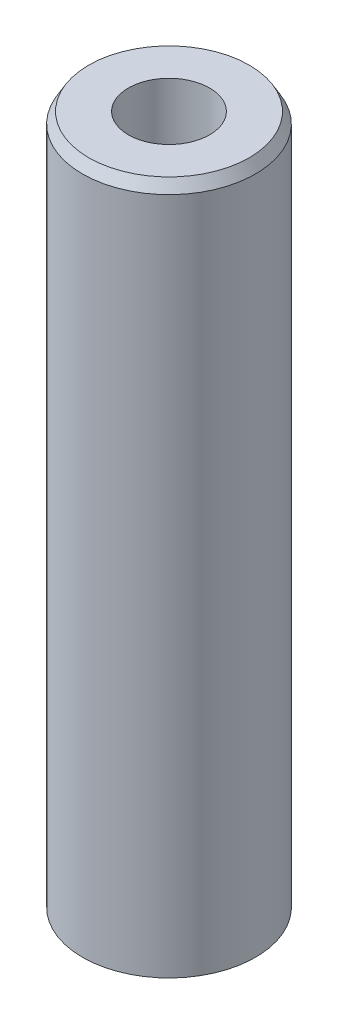
ISO-10303-21;
HEADER;
FILE_DESCRIPTION(('STEP AP214'),'2;1');
FILE_NAME('part.step','',(''),(''),'','','');
FILE_SCHEMA(('AUTOMOTIVE_DESIGN { 1 0 10303 214 1 1 1 1 }'));
ENDSEC;
DATA;
#1=APPLICATION_CONTEXT('core data for automotive mechanical design processes');
#2=APPLICATION_PROTOCOL_DEFINITION('international standard','automotive_design',2000,#1);
#3=PRODUCT_CONTEXT('',#1,'mechanical');
#4=PRODUCT('Part','Part','',(#3));
#5=PRODUCT_RELATED_PRODUCT_CATEGORY('part','',(#4));
#6=PRODUCT_DEFINITION_FORMATION('','',#4);
#7=PRODUCT_DEFINITION_CONTEXT('part definition',#1,'design');
#8=PRODUCT_DEFINITION('design','',#6,#7);
#9=PRODUCT_DEFINITION_SHAPE('','',#8);
#10=(LENGTH_UNIT() NAMED_UNIT(*) SI_UNIT(.MILLI.,.METRE.));
#11=(NAMED_UNIT(*) PLANE_ANGLE_UNIT() SI_UNIT($,.RADIAN.));
#12=(NAMED_UNIT(*) SI_UNIT($,.STERADIAN.) SOLID_ANGLE_UNIT());
#13=UNCERTAINTY_MEASURE_WITH_UNIT(LENGTH_MEASURE(1.E-05),#10,'distance_accuracy_value','');
#14=(GEOMETRIC_REPRESENTATION_CONTEXT(3) GLOBAL_UNCERTAINTY_ASSIGNED_CONTEXT((#13)) GLOBAL_UNIT_ASSIGNED_CONTEXT((#10,
#11,#12)) REPRESENTATION_CONTEXT('',''));
#15=CARTESIAN_POINT('',(0.,0.,0.));
#16=DIRECTION('',(0.,0.,1.));
#17=DIRECTION('',(1.,0.,0.));
#18=AXIS2_PLACEMENT_3D('',#15,#16,#17);
#19=CARTESIAN_POINT('',(0.,100.452609283221,0.));
#20=DIRECTION('',(0.,-1.,0.));
#21=DIRECTION('',(0.,0.,-1.));
#22=AXIS2_PLACEMENT_3D('',#19,#20,#21);
#23=CYLINDRICAL_SURFACE('',#22,12.5);
#24=CARTESIAN_POINT('',(0.,98.8770075101227,0.));
#25=DIRECTION('',(0.,1.,0.));
#26=DIRECTION('',(0.,0.,1.));
#27=AXIS2_PLACEMENT_3D('',#24,#25,#26);
#28=CIRCLE('',#27,12.5);
#29=CARTESIAN_POINT('',(0.,98.8770075101227,12.5));
#30=VERTEX_POINT('',#29);
#31=EDGE_CURVE('E50',#30,#30,#28,.F.);
#32=ORIENTED_EDGE('',*,*,#31,.T.);
#33=EDGE_LOOP('',(#32));
#34=FACE_BOUND('',#33,.T.);
#35=CARTESIAN_POINT('',(0.,0.909674107833963,0.));
#36=DIRECTION('',(0.,1.,0.));
#37=DIRECTION('',(0.,0.,1.));
#38=AXIS2_PLACEMENT_3D('',#35,#36,#37);
#39=CIRCLE('',#38,12.5);
#40=CARTESIAN_POINT('',(0.,0.909674107833963,12.5));
#41=VERTEX_POINT('',#40);
#42=EDGE_CURVE('E51',#41,#41,#39,.T.);
#43=ORIENTED_EDGE('',*,*,#42,.T.);
#44=EDGE_LOOP('',(#43));
#45=FACE_BOUND('',#44,.T.);
#46=ADVANCED_FACE('F39',(#34,#45),#23,.T.);
#47=CARTESIAN_POINT('',(0.,100.452609283221,0.));
#48=DIRECTION('',(0.,1.,0.));
#49=DIRECTION('',(0.,0.,1.));
#50=AXIS2_PLACEMENT_3D('',#47,#48,#49);
#51=PLANE('',#50);
#52=CARTESIAN_POINT('',(0.,100.452609283221,0.));
#53=DIRECTION('',(0.,1.,0.));
#54=DIRECTION('',(0.,0.,1.));
#55=AXIS2_PLACEMENT_3D('',#52,#53,#54);
#56=CIRCLE('',#55,11.590325892166);
#57=CARTESIAN_POINT('',(0.,100.452609283221,11.590325892166));
#58=VERTEX_POINT('',#57);
#59=EDGE_CURVE('E54',#58,#58,#56,.T.);
#60=ORIENTED_EDGE('',*,*,#59,.T.);
#61=EDGE_LOOP('',(#60));
#62=FACE_BOUND('',#61,.T.);
#63=CARTESIAN_POINT('',(0.,100.452609283221,0.));
#64=DIRECTION('',(0.,1.,0.));
#65=DIRECTION('',(0.,0.,1.));
#66=AXIS2_PLACEMENT_3D('',#63,#64,#65);
#67=CIRCLE('',#66,5.86471741694579);
#68=CARTESIAN_POINT('',(0.,100.452609283221,5.86471741694579));
#69=VERTEX_POINT('',#68);
#70=EDGE_CURVE('E58',#69,#69,#67,.T.);
#71=ORIENTED_EDGE('',*,*,#70,.F.);
#72=EDGE_LOOP('',(#71));
#73=FACE_BOUND('',#72,.T.);
#74=ADVANCED_FACE('F69',(#62,#73),#51,.T.);
#75=CARTESIAN_POINT('',(0.,0.,0.));
#76=DIRECTION('',(0.,1.,0.));
#77=DIRECTION('',(0.,0.,1.));
#78=AXIS2_PLACEMENT_3D('',#75,#76,#77);
#79=PLANE('',#78);
#80=CARTESIAN_POINT('',(0.,0.,0.));
#81=DIRECTION('',(0.,1.,0.));
#82=DIRECTION('',(0.,0.,1.));
#83=AXIS2_PLACEMENT_3D('',#80,#81,#82);
#84=CIRCLE('',#83,10.9243982269017);
#85=CARTESIAN_POINT('',(0.,0.,10.9243982269017));
#86=VERTEX_POINT('',#85);
#87=EDGE_CURVE('E10',#86,#86,#84,.F.);
#88=ORIENTED_EDGE('',*,*,#87,.T.);
#89=EDGE_LOOP('',(#88));
#90=FACE_BOUND('',#89,.T.);
#91=CARTESIAN_POINT('',(0.,0.,0.));
#92=DIRECTION('',(0.,1.,0.));
#93=DIRECTION('',(0.,0.,1.));
#94=AXIS2_PLACEMENT_3D('',#91,#92,#93);
#95=CIRCLE('',#94,5.86471741694579);
#96=CARTESIAN_POINT('',(0.,0.,5.86471741694579));
#97=VERTEX_POINT('',#96);
#98=EDGE_CURVE('E63',#97,#97,#95,.T.);
#99=ORIENTED_EDGE('',*,*,#98,.T.);
#100=EDGE_LOOP('',(#99));
#101=FACE_BOUND('',#100,.T.);
#102=ADVANCED_FACE('F75',(#90,#101),#79,.F.);
#103=CARTESIAN_POINT('',(0.,100.452609283221,0.));
#104=DIRECTION('',(0.,-1.,0.));
#105=DIRECTION('',(0.,0.,-1.));
#106=AXIS2_PLACEMENT_3D('',#103,#104,#105);
#107=CYLINDRICAL_SURFACE('',#106,5.86471741694579);
#108=ORIENTED_EDGE('',*,*,#70,.T.);
#109=EDGE_LOOP('',(#108));
#110=FACE_BOUND('',#109,.T.);
#111=ORIENTED_EDGE('',*,*,#98,.F.);
#112=EDGE_LOOP('',(#111));
#113=FACE_BOUND('',#112,.T.);
#114=ADVANCED_FACE('F70',(#110,#113),#107,.F.);
#115=CARTESIAN_POINT('',(0.,100.452609283221,0.));
#116=DIRECTION('',(0.,-1.,0.));
#117=DIRECTION('',(0.,0.,-1.));
#118=AXIS2_PLACEMENT_3D('',#115,#116,#117);
#119=CONICAL_SURFACE('',#118,11.590325892166,0.523598775598299);
#120=ORIENTED_EDGE('',*,*,#31,.F.);
#121=EDGE_LOOP('',(#120));
#122=FACE_BOUND('',#121,.T.);
#123=ORIENTED_EDGE('',*,*,#59,.F.);
#124=EDGE_LOOP('',(#123));
#125=FACE_BOUND('',#124,.T.);
#126=ADVANCED_FACE('F81',(#122,#125),#119,.T.);
#127=CARTESIAN_POINT('',(0.,0.909674107833963,0.));
#128=DIRECTION('',(0.,1.,0.));
#129=DIRECTION('',(0.,0.,1.));
#130=AXIS2_PLACEMENT_3D('',#127,#128,#129);
#131=CONICAL_SURFACE('',#130,12.5,1.0471975511966);
#132=CARTESIAN_POINT('',(0.,0.,10.9243982269017));
#133=CARTESIAN_POINT('',(0.,0.00947577195660385,10.9408107453714));
#134=CARTESIAN_POINT('',(0.,0.0189515439132075,10.9572232638412));
#135=CARTESIAN_POINT('',(0.,0.0379030878264149,10.9900483007808));
#136=CARTESIAN_POINT('',(0.,0.0473788597830186,11.0064608192505));
#137=CARTESIAN_POINT('',(0.,0.0663304036962263,11.0392858561901));
#138=CARTESIAN_POINT('',(0.,0.0758061756528303,11.0556983746599));
#139=CARTESIAN_POINT('',(0.,0.0947577195660379,11.0885234115994));
#140=CARTESIAN_POINT('',(0.,0.104233491522642,11.1049359300692));
#141=CARTESIAN_POINT('',(0.,0.123185035435849,11.1377609670087));
#142=CARTESIAN_POINT('',(0.,0.132660807392453,11.1541734854785));
#143=CARTESIAN_POINT('',(0.,0.15161235130566,11.1869985224181));
#144=CARTESIAN_POINT('',(0.,0.161088123262264,11.2034110408878));
#145=CARTESIAN_POINT('',(0.,0.180039667175472,11.2362360778274));
#146=CARTESIAN_POINT('',(0.,0.189515439132076,11.2526485962972));
#147=CARTESIAN_POINT('',(0.,0.208466983045283,11.2854736332367));
#148=CARTESIAN_POINT('',(0.,0.217942755001887,11.3018861517065));
#149=CARTESIAN_POINT('',(0.,0.236894298915094,11.334711188646));
#150=CARTESIAN_POINT('',(0.,0.246370070871698,11.3511237071158));
#151=CARTESIAN_POINT('',(0.,0.265321614784906,11.3839487440553));
#152=CARTESIAN_POINT('',(0.,0.27479738674151,11.4003612625251));
#153=CARTESIAN_POINT('',(0.,0.293748930654717,11.4331862994647));
#154=CARTESIAN_POINT('',(0.,0.303224702611321,11.4495988179344));
#155=CARTESIAN_POINT('',(0.,0.322176246524529,11.482423854874));
#156=CARTESIAN_POINT('',(0.,0.331652018481132,11.4988363733438));
#157=CARTESIAN_POINT('',(0.,0.35060356239434,11.5316614102833));
#158=CARTESIAN_POINT('',(0.,0.360079334350944,11.5480739287531));
#159=CARTESIAN_POINT('',(0.,0.379030878264151,11.5808989656926));
#160=CARTESIAN_POINT('',(0.,0.388506650220755,11.5973114841624));
#161=CARTESIAN_POINT('',(0.,0.407458194133963,11.630136521102));
#162=CARTESIAN_POINT('',(0.,0.416933966090566,11.6465490395717));
#163=CARTESIAN_POINT('',(0.,0.435885510003774,11.6793740765113));
#164=CARTESIAN_POINT('',(0.,0.445361281960378,11.6957865949811));
#165=CARTESIAN_POINT('',(0.,0.464312825873585,11.7286116319206));
#166=CARTESIAN_POINT('',(0.,0.473788597830189,11.7450241503904));
#167=CARTESIAN_POINT('',(0.,0.492740141743397,11.7778491873299));
#168=CARTESIAN_POINT('',(0.,0.5022159137,11.7942617057997));
#169=CARTESIAN_POINT('',(0.,0.521167457613208,11.8270867427393));
#170=CARTESIAN_POINT('',(0.,0.530643229569812,11.843499261209));
#171=CARTESIAN_POINT('',(0.,0.54959477348302,11.8763242981486));
#172=CARTESIAN_POINT('',(0.,0.559070545439623,11.8927368166184));
#173=CARTESIAN_POINT('',(0.,0.578022089352831,11.9255618535579));
#174=CARTESIAN_POINT('',(0.,0.587497861309435,11.9419743720277));
#175=CARTESIAN_POINT('',(0.,0.606449405222642,11.9747994089672));
#176=CARTESIAN_POINT('',(0.,0.615925177179246,11.991211927437));
#177=CARTESIAN_POINT('',(0.,0.634876721092454,12.0240369643765));
#178=CARTESIAN_POINT('',(0.,0.644352493049057,12.0404494828463));
#179=CARTESIAN_POINT('',(0.,0.663304036962265,12.0732745197859));
#180=CARTESIAN_POINT('',(0.,0.672779808918868,12.0896870382556));
#181=CARTESIAN_POINT('',(0.,0.691731352832076,12.1225120751952));
#182=CARTESIAN_POINT('',(0.,0.70120712478868,12.138924593665));
#183=CARTESIAN_POINT('',(0.,0.720158668701888,12.1717496306045));
#184=CARTESIAN_POINT('',(0.,0.729634440658491,12.1881621490743));
#185=CARTESIAN_POINT('',(0.,0.748585984571699,12.2209871860138));
#186=CARTESIAN_POINT('',(0.,0.758061756528303,12.2373997044836));
#187=CARTESIAN_POINT('',(0.,0.77701330044151,12.2702247414232));
#188=CARTESIAN_POINT('',(0.,0.786489072398114,12.2866372598929));
#189=CARTESIAN_POINT('',(0.,0.805440616311322,12.3194622968325));
#190=CARTESIAN_POINT('',(0.,0.814916388267925,12.3358748153023));
#191=CARTESIAN_POINT('',(0.,0.833867932181133,12.3686998522418));
#192=CARTESIAN_POINT('',(0.,0.843343704137737,12.3851123707116));
#193=CARTESIAN_POINT('',(0.,0.862295248050944,12.4179374076511));
#194=CARTESIAN_POINT('',(0.,0.871771020007548,12.4343499261209));
#195=CARTESIAN_POINT('',(0.,0.890722563920756,12.4671749630605));
#196=CARTESIAN_POINT('',(0.,0.900198335877359,12.4835874815302));
#197=CARTESIAN_POINT('',(0.,0.909674107833963,12.5));
#198=B_SPLINE_CURVE_WITH_KNOTS('',3,(#132,#133,#134,#135,#136,#137,#138,#139,#140,#141,#142,
#143,#144,#145,#146,#147,#148,#149,#150,#151,#152,#153,#154,#155,#156,#157,#158,#159,#160,#161,
#162,#163,#164,#165,#166,#167,#168,#169,#170,#171,#172,#173,#174,#175,#176,#177,#178,#179,#180,
#181,#182,#183,#184,#185,#186,#187,#188,#189,#190,#191,#192,#193,#194,#195,#196,#197),
.UNSPECIFIED.,.F.,.F.,(4,2,2,2,2,2,2,2,2,2,2,2,2,2,2,2,2,2,2,2,2,2,2,2,2,2,2,2,2,2,2,2,4),(0.,
0.0568546317396235,0.113709263479247,0.170563895218869,0.227418526958493,0.284273158698116,
0.34112779043774,0.397982422177362,0.454837053916985,0.511691685656609,0.568546317396233,
0.625400949135856,0.68225558087548,0.739110212615103,0.795964844354725,0.852819476094349,
0.909674107833972,0.966528739573596,1.02338337131322,1.08023800305284,1.13709263479247,
1.19394726653209,1.25080189827171,1.30765653001134,1.36451116175096,1.42136579349058,
1.47822042523021,1.53507505696983,1.59192968870945,1.64878432044908,1.7056389521887,
1.76249358392832,1.81934821566795),.UNSPECIFIED.);
#199=EDGE_CURVE('BSEAM45',#86,#41,#198,.T.);
#200=ORIENTED_EDGE('',*,*,#87,.F.);
#201=ORIENTED_EDGE('',*,*,#42,.F.);
#202=ORIENTED_EDGE('',*,*,#199,.T.);
#203=ORIENTED_EDGE('',*,*,#199,.F.);
#204=EDGE_LOOP('',(#200,#202,#201,#203));
#205=FACE_BOUND('',#204,.T.);
#206=ADVANCED_FACE('F45',(#205),#131,.T.);
#207=CLOSED_SHELL('',(#46,#74,#102,#114,#126,#206));
#208=MANIFOLD_SOLID_BREP('B2',#207);
#209=ADVANCED_BREP_SHAPE_REPRESENTATION('',(#18,#208),#14);
#210=SHAPE_DEFINITION_REPRESENTATION(#9,#209);
ENDSEC;
END-ISO-10303-21;
